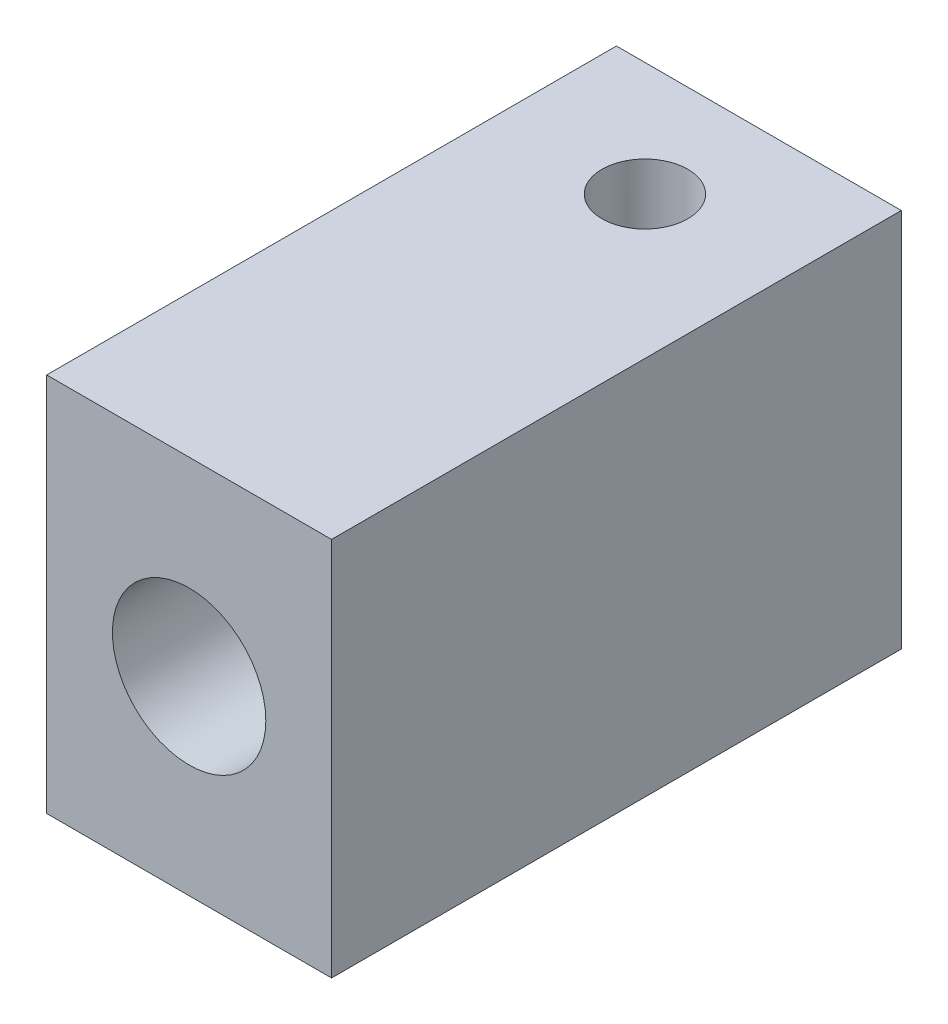
ISO-10303-21;
HEADER;
FILE_DESCRIPTION(('STEP AP214'),'2;1');
FILE_NAME('part.step','',(''),(''),'','','');
FILE_SCHEMA(('AUTOMOTIVE_DESIGN { 1 0 10303 214 1 1 1 1 }'));
ENDSEC;
DATA;
#1=APPLICATION_CONTEXT('core data for automotive mechanical design processes');
#2=APPLICATION_PROTOCOL_DEFINITION('international standard','automotive_design',2000,#1);
#3=PRODUCT_CONTEXT('',#1,'mechanical');
#4=PRODUCT('Part','Part','',(#3));
#5=PRODUCT_RELATED_PRODUCT_CATEGORY('part','',(#4));
#6=PRODUCT_DEFINITION_FORMATION('','',#4);
#7=PRODUCT_DEFINITION_CONTEXT('part definition',#1,'design');
#8=PRODUCT_DEFINITION('design','',#6,#7);
#9=PRODUCT_DEFINITION_SHAPE('','',#8);
#10=(LENGTH_UNIT() NAMED_UNIT(*) SI_UNIT(.MILLI.,.METRE.));
#11=(NAMED_UNIT(*) PLANE_ANGLE_UNIT() SI_UNIT($,.RADIAN.));
#12=(NAMED_UNIT(*) SI_UNIT($,.STERADIAN.) SOLID_ANGLE_UNIT());
#13=UNCERTAINTY_MEASURE_WITH_UNIT(LENGTH_MEASURE(1.E-05),#10,'distance_accuracy_value','');
#14=(GEOMETRIC_REPRESENTATION_CONTEXT(3) GLOBAL_UNCERTAINTY_ASSIGNED_CONTEXT((#13)) GLOBAL_UNIT_ASSIGNED_CONTEXT((#10,
#11,#12)) REPRESENTATION_CONTEXT('',''));
#15=CARTESIAN_POINT('',(0.,0.,0.));
#16=DIRECTION('',(0.,0.,1.));
#17=DIRECTION('',(1.,0.,0.));
#18=AXIS2_PLACEMENT_3D('',#15,#16,#17);
#19=CARTESIAN_POINT('',(-4.66304347826087,2.23913043478261,15.));
#20=DIRECTION('',(0.,0.,-1.));
#21=DIRECTION('',(-1.,0.,0.));
#22=AXIS2_PLACEMENT_3D('',#19,#20,#21);
#23=CYLINDRICAL_SURFACE('',#22,1.1);
#24=CARTESIAN_POINT('',(-5.76304347826087,2.23913043478261,3.25995786196997));
#25=CARTESIAN_POINT('',(-5.76304202984464,2.25692156335631,3.25996743238746));
#26=CARTESIAN_POINT('',(-5.76260412839036,2.27474189413633,3.26183738780478));
#27=CARTESIAN_POINT('',(-5.76091788793131,2.30972254960981,3.26881457219472));
#28=CARTESIAN_POINT('',(-5.75966543122651,2.32687904909059,3.27393824608749));
#29=CARTESIAN_POINT('',(-5.75542488410556,2.37136076469578,3.29050074038941));
#30=CARTESIAN_POINT('',(-5.75183652945316,2.39787262369145,3.30387376602195));
#31=CARTESIAN_POINT('',(-5.74314937282368,2.44900373270586,3.33345642892709));
#32=CARTESIAN_POINT('',(-5.73804332131031,2.47361316789121,3.34967952437635));
#33=CARTESIAN_POINT('',(-5.7232425484458,2.53484972201438,3.39283805494884));
#34=CARTESIAN_POINT('',(-5.71257379296082,2.57056794945104,3.42072248982322));
#35=CARTESIAN_POINT('',(-5.68801745666639,2.64010804758875,3.47746698613262));
#36=CARTESIAN_POINT('',(-5.67412487293764,2.67392686831241,3.50632850378182));
#37=CARTESIAN_POINT('',(-5.64307189579393,2.7400058004621,3.56408920713508));
#38=CARTESIAN_POINT('',(-5.62591173427369,2.77226602229581,3.59298839002164));
#39=CARTESIAN_POINT('',(-5.58823994527732,2.8352475248608,3.65020265086913));
#40=CARTESIAN_POINT('',(-5.5677310593376,2.86597003782636,3.6785181854724));
#41=CARTESIAN_POINT('',(-5.51004427419463,2.9434848002313,3.75058806672391));
#42=CARTESIAN_POINT('',(-5.47017867317616,2.98904261620317,3.79357590917881));
#43=CARTESIAN_POINT('',(-5.38110292180772,3.07470914645192,3.87498446052813));
#44=CARTESIAN_POINT('',(-5.33191358862542,3.11482966475285,3.91341503950037));
#45=CARTESIAN_POINT('',(-5.23784781455594,3.17824626851377,3.97440357278692));
#46=CARTESIAN_POINT('',(-5.19510868192778,3.20321688909233,3.99850307899509));
#47=CARTESIAN_POINT('',(-5.10460139320199,3.24787393881108,4.04168573624983));
#48=CARTESIAN_POINT('',(-5.05683894096868,3.2675662730262,4.06077449256676));
#49=CARTESIAN_POINT('',(-4.96462111635331,3.29792207694609,4.09023236882376));
#50=CARTESIAN_POINT('',(-4.92075049081482,3.30949853112091,4.10148159832432));
#51=CARTESIAN_POINT('',(-4.83091512625936,3.32720687300066,4.11869748658754));
#52=CARTESIAN_POINT('',(-4.78495164570597,3.3333419883681,4.1246672769719));
#53=CARTESIAN_POINT('',(-4.69209020076544,3.33973382440618,4.13088697749982));
#54=CARTESIAN_POINT('',(-4.64518992180941,3.33997352470415,4.13112032623439));
#55=CARTESIAN_POINT('',(-4.55207074206756,3.3345122392381,4.12580593456318));
#56=CARTESIAN_POINT('',(-4.50585193860986,3.32881041308419,4.12025737634465));
#57=CARTESIAN_POINT('',(-4.41738005657088,3.31225222160596,4.10415801298817));
#58=CARTESIAN_POINT('',(-4.37504191494482,3.30162563246535,4.09383022277266));
#59=CARTESIAN_POINT('',(-4.2930782852121,3.27593982430762,4.0688977097035));
#60=CARTESIAN_POINT('',(-4.25345381045951,3.26087896042193,4.05429139976797));
#61=CARTESIAN_POINT('',(-4.16237361023026,3.22030417590561,4.01500968644353));
#62=CARTESIAN_POINT('',(-4.11244047712288,3.19301217887642,3.98863696740781));
#63=CARTESIAN_POINT('',(-4.01936097201772,3.1328639603237,3.93073650868733));
#64=CARTESIAN_POINT('',(-3.97622981015617,3.09999560039696,3.89919752857183));
#65=CARTESIAN_POINT('',(-3.88206514062166,3.01715783910102,3.8201821758641));
#66=CARTESIAN_POINT('',(-3.83398917797516,2.96535376007229,3.77111950795292));
#67=CARTESIAN_POINT('',(-3.74976566796874,2.85614158519799,3.66922460217595));
#68=CARTESIAN_POINT('',(-3.71362924916669,2.7987283253778,3.61638890301836));
#69=CARTESIAN_POINT('',(-3.66345339107535,2.70030169691803,3.52910919279121));
#70=CARTESIAN_POINT('',(-3.64613124390974,2.66075324028943,3.49483510118186));
#71=CARTESIAN_POINT('',(-3.61599940476486,2.57914027990991,3.42733452427061));
#72=CARTESIAN_POINT('',(-3.60318147093975,2.53708053812963,3.39410622791395));
#73=CARTESIAN_POINT('',(-3.58794498894286,2.47275929268058,3.34923651656145));
#74=CARTESIAN_POINT('',(-3.58367280742767,2.45224983508988,3.33572760960861));
#75=CARTESIAN_POINT('',(-3.57616625939737,2.40989914127057,3.31055595366563));
#76=CARTESIAN_POINT('',(-3.57293132581379,2.38805864052916,3.29889219769569));
#77=CARTESIAN_POINT('',(-3.56853998201005,2.35003065047467,3.28229327236621));
#78=CARTESIAN_POINT('',(-3.56704974013343,2.33431232864633,3.27640324603437));
#79=CARTESIAN_POINT('',(-3.56473237167539,2.30214543947803,3.2670474016854));
#80=CARTESIAN_POINT('',(-3.56390277674675,2.28569983500821,3.26357256614566));
#81=CARTESIAN_POINT('',(-3.56299244917421,2.25219103246751,3.25975154051829));
#82=CARTESIAN_POINT('',(-3.56292119328755,2.2351226877681,3.25944494442878));
#83=CARTESIAN_POINT('',(-3.5635643522341,2.20126172756535,3.26215450956048));
#84=CARTESIAN_POINT('',(-3.56428008336151,2.18446962183639,3.26517623766561));
#85=CARTESIAN_POINT('',(-3.56675290814509,2.14624995930651,3.27524173017821));
#86=CARTESIAN_POINT('',(-3.56877539258835,2.12511779398725,3.28328257505928));
#87=CARTESIAN_POINT('',(-3.573813996874,2.08418508186905,3.30208119570021));
#88=CARTESIAN_POINT('',(-3.57683549868156,2.06439246305172,3.31285361222076));
#89=CARTESIAN_POINT('',(-3.58590586155399,2.01375655290057,3.34312050478321));
#90=CARTESIAN_POINT('',(-3.59266364475598,1.98379059641202,3.36384004055668));
#91=CARTESIAN_POINT('',(-3.60825631473124,1.92555444666572,3.40685940310628));
#92=CARTESIAN_POINT('',(-3.61709584096879,1.89728822075011,3.42916268078441));
#93=CARTESIAN_POINT('',(-3.63684339996749,1.84191659787366,3.47445018277957));
#94=CARTESIAN_POINT('',(-3.64775674925715,1.81481440896243,3.4974360262756));
#95=CARTESIAN_POINT('',(-3.6716426744066,1.76166757787371,3.54348544381327));
#96=CARTESIAN_POINT('',(-3.68461327204409,1.73562194963128,3.56654892255869));
#97=CARTESIAN_POINT('',(-3.7294969120017,1.65379569148066,3.63997237502955));
#98=CARTESIAN_POINT('',(-3.76548093950229,1.59979111215946,3.68991752316887));
#99=CARTESIAN_POINT('',(-3.84830253133314,1.4971599157433,3.78599884416798));
#100=CARTESIAN_POINT('',(-3.89510978744304,1.44851883085125,3.83214517438103));
#101=CARTESIAN_POINT('',(-3.98602538044757,1.37068662808733,3.90646457461495));
#102=CARTESIAN_POINT('',(-4.0274472726292,1.33979083150459,3.93612546350313));
#103=CARTESIAN_POINT('',(-4.11646861555114,1.28308016286914,3.99073310534093));
#104=CARTESIAN_POINT('',(-4.16406178891903,1.25726019397885,4.01568458617671));
#105=CARTESIAN_POINT('',(-4.25621351160494,1.21610747926852,4.05552473568121));
#106=CARTESIAN_POINT('',(-4.29987187790399,1.19973312226909,4.07140757844398));
#107=CARTESIAN_POINT('',(-4.3903817577433,1.17241379143515,4.09793065140252));
#108=CARTESIAN_POINT('',(-4.43723101557245,1.16146502652541,4.10857454222553));
#109=CARTESIAN_POINT('',(-4.53321783019467,1.14573122273902,4.12387566887657));
#110=CARTESIAN_POINT('',(-4.58236703749928,1.14098213746161,4.12849798365546));
#111=CARTESIAN_POINT('',(-4.68103577081436,1.13817193644223,4.1312327655113));
#112=CARTESIAN_POINT('',(-4.730555201667,1.14010915736384,4.12934685162476));
#113=CARTESIAN_POINT('',(-4.82358659426562,1.14999916374567,4.11972493521201));
#114=CARTESIAN_POINT('',(-4.86722379478441,1.15736571029336,4.11255906308958));
#115=CARTESIAN_POINT('',(-4.95231459557117,1.17694887193364,4.09352752703682));
#116=CARTESIAN_POINT('',(-4.9937677222926,1.18916653397372,4.08166084859938));
#117=CARTESIAN_POINT('',(-5.07628909452977,1.21870396007352,4.05301210326653));
#118=CARTESIAN_POINT('',(-5.11716536325337,1.23629868627169,4.03596552503223));
#119=CARTESIAN_POINT('',(-5.19512824640087,1.2753924686259,3.99817036042982));
#120=CARTESIAN_POINT('',(-5.23221349933046,1.29689291982785,3.97742045135345));
#121=CARTESIAN_POINT('',(-5.32225064503326,1.35608677888888,3.92046007960291));
#122=CARTESIAN_POINT('',(-5.37235824883861,1.39607492300427,3.88212922735891));
#123=CARTESIAN_POINT('',(-5.46318503944131,1.48170423170636,3.80068212176098));
#124=CARTESIAN_POINT('',(-5.50386785689384,1.52736628380901,3.75754825127072));
#125=CARTESIAN_POINT('',(-5.56370443952876,1.60640210968032,3.68395574642606));
#126=CARTESIAN_POINT('',(-5.58544280372698,1.63857850005985,3.65425986599595));
#127=CARTESIAN_POINT('',(-5.62522873004572,1.70463127967671,3.59420051700583));
#128=CARTESIAN_POINT('',(-5.64327241667805,1.73850940802967,3.56383638407775));
#129=CARTESIAN_POINT('',(-5.67570881917522,1.80788644904845,3.50325534159816));
#130=CARTESIAN_POINT('',(-5.69011173495948,1.84338049734566,3.47303825867273));
#131=CARTESIAN_POINT('',(-5.71537582694509,1.91648418388774,3.41375684165734));
#132=CARTESIAN_POINT('',(-5.72624393391357,1.9540895105641,3.38469035112288));
#133=CARTESIAN_POINT('',(-5.73980724416575,2.01332326434638,3.34404647818908));
#134=CARTESIAN_POINT('',(-5.74387845279662,2.03359191631187,3.33096279143475));
#135=CARTESIAN_POINT('',(-5.75100316349188,2.07544040353468,3.30672215660767));
#136=CARTESIAN_POINT('',(-5.75405832648633,2.09701803003937,3.29556207854428));
#137=CARTESIAN_POINT('',(-5.75822515756423,2.13508942787357,3.27964630361837));
#138=CARTESIAN_POINT('',(-5.75964507989362,2.15115360537918,3.27397419995838));
#139=CARTESIAN_POINT('',(-5.76178330293547,2.18401271225461,3.2652737680339));
#140=CARTESIAN_POINT('',(-5.76250461285836,2.2008041790456,3.26223410680792));
#141=CARTESIAN_POINT('',(-5.76297420187904,2.22484045405145,3.26025042414968));
#142=CARTESIAN_POINT('',(-5.76304406014263,2.23198308791189,3.25995401718332));
#143=CARTESIAN_POINT('',(-5.76304347826087,2.23913043478261,3.25995786196997));
#144=B_SPLINE_CURVE_WITH_KNOTS('',3,(#24,#25,#26,#27,#28,#29,#30,#31,#32,#33,#34,#35,#36,#37,
#38,#39,#40,#41,#42,#43,#44,#45,#46,#47,#48,#49,#50,#51,#52,#53,#54,#55,#56,#57,#58,#59,#60,#61,
#62,#63,#64,#65,#66,#67,#68,#69,#70,#71,#72,#73,#74,#75,#76,#77,#78,#79,#80,#81,#82,#83,#84,#85,
#86,#87,#88,#89,#90,#91,#92,#93,#94,#95,#96,#97,#98,#99,#100,#101,#102,#103,#104,#105,#106,#107,
#108,#109,#110,#111,#112,#113,#114,#115,#116,#117,#118,#119,#120,#121,#122,#123,#124,#125,#126,
#127,#128,#129,#130,#131,#132,#133,#134,#135,#136,#137,#138,#139,#140,#141,#142,#143),
.UNSPECIFIED.,.T.,.F.,(4,2,2,2,2,2,2,2,2,2,2,2,2,2,2,2,2,2,2,2,2,2,2,2,2,2,2,2,2,2,2,2,2,2,2,2,
2,2,2,2,2,2,2,2,2,2,2,2,2,2,2,2,2,2,2,2,2,2,2,4),(0.,0.0533426910420637,0.106957155695794,
0.196176524477837,0.285829107453229,0.425229406600042,0.564847499088044,0.704455686796717,
0.843950147808111,1.06589174474377,1.28734352664652,1.45191584352115,1.61630326953405,
1.7559410213299,1.89549588809166,2.03545360992971,2.17543113055567,2.3094494464229,
2.44351753837802,2.630635535726,2.8181661964035,3.0749013799203,3.331875189383,3.49708416617617,
3.66198924853849,3.7367099429019,3.8113897171714,3.86180299462687,3.91202701958199,
3.9628779543289,4.01381407059116,4.08153086041255,4.14961856949937,4.26052083977127,
4.37167265058426,4.48311335535701,4.59444754276799,4.83922069465635,5.08331653753397,
5.26147511476181,5.4394538717954,5.58663227720997,5.73370769774582,5.88163231360184,
6.02952013325713,6.1634217043346,6.29735218921119,6.43979644086572,6.58229167112106,
6.80513446872085,7.02882338020418,7.17531734893754,7.32196420237837,7.46819554181519,
7.61413840955297,7.68746973666915,7.76068059295988,7.8118098699113,7.86271791947203,
7.88414762890928),.UNSPECIFIED.);
#145=CARTESIAN_POINT('',(-5.76304347826087,2.23913043478261,3.25995786196997));
#146=VERTEX_POINT('',#145);
#147=EDGE_CURVE('E119',#146,#146,#144,.T.);
#148=ORIENTED_EDGE('',*,*,#147,.T.);
#149=EDGE_LOOP('',(#148));
#150=FACE_BOUND('',#149,.T.);
#151=CARTESIAN_POINT('',(-4.66304347826087,2.23913043478261,7.5));
#152=DIRECTION('',(0.,0.,1.));
#153=DIRECTION('',(1.,0.,0.));
#154=AXIS2_PLACEMENT_3D('',#151,#152,#153);
#155=CIRCLE('',#154,1.1);
#156=CARTESIAN_POINT('',(-3.56304347826087,2.23913043478261,7.5));
#157=VERTEX_POINT('',#156);
#158=EDGE_CURVE('E37',#157,#157,#155,.F.);
#159=ORIENTED_EDGE('',*,*,#158,.F.);
#160=EDGE_LOOP('',(#159));
#161=FACE_BOUND('',#160,.T.);
#162=ADVANCED_FACE('F33',(#150,#161),#23,.F.);
#163=CARTESIAN_POINT('',(-5.76304347826087,2.23913043478261,2.74004213803004));
#164=CARTESIAN_POINT('',(-5.76304202984464,2.22133930620891,2.74003256761254));
#165=CARTESIAN_POINT('',(-5.76260412839036,2.20351897542889,2.73816261219522));
#166=CARTESIAN_POINT('',(-5.76091788793131,2.16853831995541,2.73118542780528));
#167=CARTESIAN_POINT('',(-5.75966543122651,2.15138182047463,2.72606175391251));
#168=CARTESIAN_POINT('',(-5.75542488410556,2.10690010486944,2.70949925961059));
#169=CARTESIAN_POINT('',(-5.75183652945316,2.08038824587377,2.69612623397805));
#170=CARTESIAN_POINT('',(-5.74314937282368,2.02925713685935,2.66654357107291));
#171=CARTESIAN_POINT('',(-5.73804332131031,2.00464770167401,2.65032047562365));
#172=CARTESIAN_POINT('',(-5.7232425484458,1.94341114755083,2.60716194505116));
#173=CARTESIAN_POINT('',(-5.71257379296082,1.90769292011418,2.57927751017678));
#174=CARTESIAN_POINT('',(-5.68801745666639,1.83815282197647,2.52253301386738));
#175=CARTESIAN_POINT('',(-5.67412487293764,1.80433400125281,2.49367149621818));
#176=CARTESIAN_POINT('',(-5.64307189579393,1.73825506910312,2.43591079286492));
#177=CARTESIAN_POINT('',(-5.62591173427368,1.70599484726941,2.40701160997836));
#178=CARTESIAN_POINT('',(-5.58823994527732,1.64301334470442,2.34979734913087));
#179=CARTESIAN_POINT('',(-5.56773105933759,1.61229083173885,2.3214818145276));
#180=CARTESIAN_POINT('',(-5.51004427419463,1.53477606933391,2.24941193327609));
#181=CARTESIAN_POINT('',(-5.47017867317616,1.48921825336205,2.20642409082119));
#182=CARTESIAN_POINT('',(-5.38110292180772,1.4035517231133,2.12501553947187));
#183=CARTESIAN_POINT('',(-5.33191358862542,1.36343120481236,2.08658496049963));
#184=CARTESIAN_POINT('',(-5.23784781455594,1.30001460105145,2.02559642721308));
#185=CARTESIAN_POINT('',(-5.19510868192778,1.27504398047289,2.00149692100491));
#186=CARTESIAN_POINT('',(-5.10460139320199,1.23038693075414,1.95831426375017));
#187=CARTESIAN_POINT('',(-5.05683894096868,1.21069459653902,1.93922550743324));
#188=CARTESIAN_POINT('',(-4.96462111635331,1.18033879261913,1.90976763117624));
#189=CARTESIAN_POINT('',(-4.92075049081482,1.16876233844431,1.89851840167568));
#190=CARTESIAN_POINT('',(-4.83091512625936,1.15105399656456,1.88130251341246));
#191=CARTESIAN_POINT('',(-4.78495164570597,1.14491888119711,1.8753327230281));
#192=CARTESIAN_POINT('',(-4.69209020076544,1.13852704515904,1.86911302250018));
#193=CARTESIAN_POINT('',(-4.64518992180941,1.13828734486107,1.86887967376562));
#194=CARTESIAN_POINT('',(-4.55207074206756,1.14374863032712,1.87419406543682));
#195=CARTESIAN_POINT('',(-4.50585193860986,1.14945045648103,1.87974262365535));
#196=CARTESIAN_POINT('',(-4.41738005657088,1.16600864795926,1.89584198701183));
#197=CARTESIAN_POINT('',(-4.37504191494482,1.17663523709986,1.90616977722734));
#198=CARTESIAN_POINT('',(-4.2930782852121,1.20232104525759,1.9311022902965));
#199=CARTESIAN_POINT('',(-4.25345381045951,1.21738190914329,1.94570860023203));
#200=CARTESIAN_POINT('',(-4.16237361023026,1.25795669365961,1.98499031355647));
#201=CARTESIAN_POINT('',(-4.11244047712288,1.2852486906888,2.01136303259219));
#202=CARTESIAN_POINT('',(-4.01936097201772,1.34539690924152,2.06926349131267));
#203=CARTESIAN_POINT('',(-3.97622981015617,1.37826526916825,2.10080247142817));
#204=CARTESIAN_POINT('',(-3.88206514062166,1.4611030304642,2.1798178241359));
#205=CARTESIAN_POINT('',(-3.83398917797516,1.51290710949293,2.22888049204708));
#206=CARTESIAN_POINT('',(-3.74976566796874,1.62211928436723,2.33077539782405));
#207=CARTESIAN_POINT('',(-3.71362924916669,1.67953254418742,2.38361109698164));
#208=CARTESIAN_POINT('',(-3.66345339107535,1.77795917264719,2.47089080720879));
#209=CARTESIAN_POINT('',(-3.64613124390974,1.81750762927579,2.50516489881814));
#210=CARTESIAN_POINT('',(-3.61599940476486,1.89912058965531,2.57266547572939));
#211=CARTESIAN_POINT('',(-3.60318147093975,1.94118033143559,2.60589377208605));
#212=CARTESIAN_POINT('',(-3.58794498894286,2.00550157688464,2.65076348343855));
#213=CARTESIAN_POINT('',(-3.58367280742767,2.02601103447534,2.66427239039139));
#214=CARTESIAN_POINT('',(-3.57616625939737,2.06836172829465,2.68944404633437));
#215=CARTESIAN_POINT('',(-3.57293132581379,2.09020222903606,2.70110780230431));
#216=CARTESIAN_POINT('',(-3.56853998201005,2.12823021909054,2.71770672763379));
#217=CARTESIAN_POINT('',(-3.56704974013343,2.14394854091889,2.72359675396563));
#218=CARTESIAN_POINT('',(-3.56473237167539,2.17611543008719,2.7329525983146));
#219=CARTESIAN_POINT('',(-3.56390277674675,2.19256103455701,2.73642743385434));
#220=CARTESIAN_POINT('',(-3.56299244917421,2.22606983709771,2.74024845948171));
#221=CARTESIAN_POINT('',(-3.56292119328755,2.24313818179712,2.74055505557122));
#222=CARTESIAN_POINT('',(-3.5635643522341,2.27699914199986,2.73784549043952));
#223=CARTESIAN_POINT('',(-3.56428008336151,2.29379124772883,2.73482376233439));
#224=CARTESIAN_POINT('',(-3.56675290814509,2.33201091025871,2.72475826982179));
#225=CARTESIAN_POINT('',(-3.56877539258835,2.35314307557797,2.71671742494072));
#226=CARTESIAN_POINT('',(-3.573813996874,2.39407578769617,2.69791880429979));
#227=CARTESIAN_POINT('',(-3.57683549868156,2.41386840651349,2.68714638777924));
#228=CARTESIAN_POINT('',(-3.58590586155399,2.46450431666465,2.65687949521679));
#229=CARTESIAN_POINT('',(-3.59266364475598,2.4944702731532,2.63615995944332));
#230=CARTESIAN_POINT('',(-3.60825631473124,2.5527064228995,2.59314059689372));
#231=CARTESIAN_POINT('',(-3.61709584096879,2.58097264881511,2.57083731921559));
#232=CARTESIAN_POINT('',(-3.63684339996749,2.63634427169156,2.52554981722043));
#233=CARTESIAN_POINT('',(-3.64775674925715,2.66344646060279,2.5025639737244));
#234=CARTESIAN_POINT('',(-3.6716426744066,2.71659329169151,2.45651455618673));
#235=CARTESIAN_POINT('',(-3.68461327204409,2.74263891993394,2.43345107744131));
#236=CARTESIAN_POINT('',(-3.7294969120017,2.82446517808456,2.36002762497045));
#237=CARTESIAN_POINT('',(-3.76548093950229,2.87846975740576,2.31008247683113));
#238=CARTESIAN_POINT('',(-3.84830253133314,2.98110095382192,2.21400115583202));
#239=CARTESIAN_POINT('',(-3.89510978744304,3.02974203871396,2.16785482561897));
#240=CARTESIAN_POINT('',(-3.98602538044757,3.10757424147789,2.09353542538505));
#241=CARTESIAN_POINT('',(-4.0274472726292,3.13847003806062,2.06387453649687));
#242=CARTESIAN_POINT('',(-4.11646861555114,3.19518070669607,2.00926689465907));
#243=CARTESIAN_POINT('',(-4.16406178891903,3.22100067558637,1.98431541382329));
#244=CARTESIAN_POINT('',(-4.25621351160494,3.2621533902967,1.94447526431879));
#245=CARTESIAN_POINT('',(-4.29987187790398,3.27852774729613,1.92859242155603));
#246=CARTESIAN_POINT('',(-4.3903817577433,3.30584707813007,1.90206934859748));
#247=CARTESIAN_POINT('',(-4.43723101557245,3.31679584303981,1.89142545777448));
#248=CARTESIAN_POINT('',(-4.53321783019467,3.3325296468262,1.87612433112344));
#249=CARTESIAN_POINT('',(-4.58236703749927,3.33727873210361,1.87150201634454));
#250=CARTESIAN_POINT('',(-4.68103577081436,3.34008893312299,1.8687672344887));
#251=CARTESIAN_POINT('',(-4.730555201667,3.33815171220137,1.87065314837524));
#252=CARTESIAN_POINT('',(-4.82358659426562,3.32826170581955,1.88027506478799));
#253=CARTESIAN_POINT('',(-4.86722379478441,3.32089515927186,1.88744093691042));
#254=CARTESIAN_POINT('',(-4.95231459557117,3.30131199763158,1.90647247296318));
#255=CARTESIAN_POINT('',(-4.9937677222926,3.2890943355915,1.91833915140062));
#256=CARTESIAN_POINT('',(-5.07628909452977,3.2595569094917,1.94698789673347));
#257=CARTESIAN_POINT('',(-5.11716536325336,3.24196218329353,1.96403447496777));
#258=CARTESIAN_POINT('',(-5.19512824640087,3.20286840093932,2.00182963957018));
#259=CARTESIAN_POINT('',(-5.23221349933046,3.18136794973737,2.02257954864655));
#260=CARTESIAN_POINT('',(-5.32225064503326,3.12217409067634,2.07953992039709));
#261=CARTESIAN_POINT('',(-5.3723582488386,3.08218594656095,2.11787077264109));
#262=CARTESIAN_POINT('',(-5.4631850394413,2.99655663785886,2.19931787823902));
#263=CARTESIAN_POINT('',(-5.50386785689384,2.95089458575621,2.24245174872928));
#264=CARTESIAN_POINT('',(-5.56370443952876,2.8718587598849,2.31604425357394));
#265=CARTESIAN_POINT('',(-5.58544280372698,2.83968236950538,2.34574013400405));
#266=CARTESIAN_POINT('',(-5.62522873004571,2.77362958988851,2.40579948299417));
#267=CARTESIAN_POINT('',(-5.64327241667805,2.73975146153555,2.43616361592225));
#268=CARTESIAN_POINT('',(-5.67570881917522,2.67037442051677,2.49674465840184));
#269=CARTESIAN_POINT('',(-5.69011173495948,2.63488037221956,2.52696174132727));
#270=CARTESIAN_POINT('',(-5.71537582694509,2.56177668567748,2.58624315834266));
#271=CARTESIAN_POINT('',(-5.72624393391357,2.52417135900112,2.61530964887711));
#272=CARTESIAN_POINT('',(-5.73980724416575,2.46493760521884,2.65595352181091));
#273=CARTESIAN_POINT('',(-5.74387845279662,2.44466895325335,2.66903720856525));
#274=CARTESIAN_POINT('',(-5.75100316349188,2.40282046603054,2.69327784339233));
#275=CARTESIAN_POINT('',(-5.75405832648633,2.38124283952585,2.70443792145572));
#276=CARTESIAN_POINT('',(-5.75822515756423,2.34317144169165,2.72035369638163));
#277=CARTESIAN_POINT('',(-5.75964507989362,2.32710726418604,2.72602580004162));
#278=CARTESIAN_POINT('',(-5.76178330293547,2.29424815731061,2.7347262319661));
#279=CARTESIAN_POINT('',(-5.76250461285836,2.27745669051962,2.73776589319208));
#280=CARTESIAN_POINT('',(-5.76297420187904,2.25342041551377,2.73974957585032));
#281=CARTESIAN_POINT('',(-5.76304406014263,2.24627778165333,2.74004598281668));
#282=CARTESIAN_POINT('',(-5.76304347826087,2.23913043478261,2.74004213803004));
#283=B_SPLINE_CURVE_WITH_KNOTS('',3,(#163,#164,#165,#166,#167,#168,#169,#170,#171,#172,#173,
#174,#175,#176,#177,#178,#179,#180,#181,#182,#183,#184,#185,#186,#187,#188,#189,#190,#191,#192,
#193,#194,#195,#196,#197,#198,#199,#200,#201,#202,#203,#204,#205,#206,#207,#208,#209,#210,#211,
#212,#213,#214,#215,#216,#217,#218,#219,#220,#221,#222,#223,#224,#225,#226,#227,#228,#229,#230,
#231,#232,#233,#234,#235,#236,#237,#238,#239,#240,#241,#242,#243,#244,#245,#246,#247,#248,#249,
#250,#251,#252,#253,#254,#255,#256,#257,#258,#259,#260,#261,#262,#263,#264,#265,#266,#267,#268,
#269,#270,#271,#272,#273,#274,#275,#276,#277,#278,#279,#280,#281,#282),.UNSPECIFIED.,.T.,.F.,(4,
2,2,2,2,2,2,2,2,2,2,2,2,2,2,2,2,2,2,2,2,2,2,2,2,2,2,2,2,2,2,2,2,2,2,2,2,2,2,2,2,2,2,2,2,2,2,2,2,
2,2,2,2,2,2,2,2,2,2,4),(0.,0.0533426910420634,0.106957155695794,0.196176524477838,
0.285829107453229,0.425229406600042,0.564847499088045,0.704455686796717,0.843950147808112,
1.06589174474377,1.28734352664652,1.45191584352115,1.61630326953405,1.7559410213299,
1.89549588809166,2.03545360992971,2.17543113055567,2.3094494464229,2.44351753837802,
2.630635535726,2.8181661964035,3.0749013799203,3.331875189383,3.49708416617617,3.66198924853849,
3.7367099429019,3.8113897171714,3.86180299462687,3.91202701958199,3.9628779543289,
4.01381407059116,4.08153086041255,4.14961856949937,4.26052083977127,4.37167265058426,
4.48311335535701,4.594447542768,4.83922069465636,5.08331653753398,5.26147511476181,
5.4394538717954,5.58663227720997,5.73370769774582,5.88163231360184,6.02952013325713,
6.1634217043346,6.29735218921119,6.43979644086571,6.58229167112106,6.80513446872084,
7.02882338020417,7.17531734893753,7.32196420237837,7.46819554181519,7.61413840955296,
7.68746973666915,7.76068059295987,7.8118098699113,7.86271791947203,7.88414762890928),.UNSPECIFIED.);
#284=CARTESIAN_POINT('',(-5.76304347826087,2.23913043478261,2.74004213803004));
#285=VERTEX_POINT('',#284);
#286=EDGE_CURVE('E128',#285,#285,#283,.T.);
#287=ORIENTED_EDGE('',*,*,#286,.T.);
#288=EDGE_LOOP('',(#287));
#289=FACE_BOUND('',#288,.T.);
#290=CARTESIAN_POINT('',(-4.66304347826087,2.23913043478261,0.));
#291=DIRECTION('',(0.,0.,-1.));
#292=DIRECTION('',(-1.,0.,0.));
#293=AXIS2_PLACEMENT_3D('',#290,#291,#292);
#294=CIRCLE('',#293,1.1);
#295=CARTESIAN_POINT('',(-5.76304347826087,2.23913043478261,0.));
#296=VERTEX_POINT('',#295);
#297=EDGE_CURVE('E102',#296,#296,#294,.T.);
#298=ORIENTED_EDGE('',*,*,#297,.T.);
#299=EDGE_LOOP('',(#298));
#300=FACE_BOUND('',#299,.T.);
#301=ADVANCED_FACE('F132',(#289,#300),#23,.F.);
#302=CARTESIAN_POINT('',(-8.41304347826087,7.23913043478261,15.));
#303=DIRECTION('',(1.,0.,0.));
#304=DIRECTION('',(0.,0.,-1.));
#305=AXIS2_PLACEMENT_3D('',#302,#303,#304);
#306=PLANE('',#305);
#307=DIRECTION('',(0.,-1.,0.));
#308=VECTOR('',#307,1.);
#309=CARTESIAN_POINT('',(-8.41304347826087,7.23913043478261,0.));
#310=LINE('',#309,#308);
#311=CARTESIAN_POINT('',(-8.41304347826087,7.23913043478261,0.));
#312=VERTEX_POINT('',#311);
#313=CARTESIAN_POINT('',(-8.41304347826087,-2.76086956521739,0.));
#314=VERTEX_POINT('',#313);
#315=EDGE_CURVE('E99',#312,#314,#310,.T.);
#316=ORIENTED_EDGE('',*,*,#315,.T.);
#317=DIRECTION('',(0.,0.,-1.));
#318=VECTOR('',#317,1.);
#319=CARTESIAN_POINT('',(-8.41304347826087,-2.76086956521739,15.));
#320=LINE('',#319,#318);
#321=CARTESIAN_POINT('',(-8.41304347826087,-2.76086956521739,15.));
#322=VERTEX_POINT('',#321);
#323=EDGE_CURVE('E11',#322,#314,#320,.T.);
#324=ORIENTED_EDGE('',*,*,#323,.F.);
#325=DIRECTION('',(0.,-1.,0.));
#326=VECTOR('',#325,1.);
#327=CARTESIAN_POINT('',(-8.41304347826087,7.23913043478261,15.));
#328=LINE('',#327,#326);
#329=CARTESIAN_POINT('',(-8.41304347826087,7.23913043478261,15.));
#330=VERTEX_POINT('',#329);
#331=EDGE_CURVE('E86',#330,#322,#328,.T.);
#332=ORIENTED_EDGE('',*,*,#331,.F.);
#333=DIRECTION('',(0.,0.,-1.));
#334=VECTOR('',#333,1.);
#335=CARTESIAN_POINT('',(-8.41304347826087,7.23913043478261,15.));
#336=LINE('',#335,#334);
#337=EDGE_CURVE('E95',#330,#312,#336,.T.);
#338=ORIENTED_EDGE('',*,*,#337,.T.);
#339=EDGE_LOOP('',(#316,#324,#332,#338));
#340=FACE_BOUND('',#339,.T.);
#341=ADVANCED_FACE('F35',(#340),#306,.F.);
#342=CARTESIAN_POINT('',(-8.41304347826087,-2.76086956521739,15.));
#343=DIRECTION('',(0.,1.,0.));
#344=DIRECTION('',(0.,0.,1.));
#345=AXIS2_PLACEMENT_3D('',#342,#343,#344);
#346=PLANE('',#345);
#347=CARTESIAN_POINT('',(-4.66304347826087,-2.76086956521739,3.));
#348=DIRECTION('',(0.,1.,0.));
#349=DIRECTION('',(-1.,0.,0.));
#350=AXIS2_PLACEMENT_3D('',#347,#348,#349);
#351=CIRCLE('',#350,1.1303);
#352=CARTESIAN_POINT('',(-5.79334347826087,-2.76086956521739,3.));
#353=VERTEX_POINT('',#352);
#354=EDGE_CURVE('E189',#353,#353,#351,.T.);
#355=ORIENTED_EDGE('',*,*,#354,.T.);
#356=EDGE_LOOP('',(#355));
#357=FACE_BOUND('',#356,.T.);
#358=DIRECTION('',(1.,0.,0.));
#359=VECTOR('',#358,1.);
#360=CARTESIAN_POINT('',(-8.41304347826087,-2.76086956521739,0.));
#361=LINE('',#360,#359);
#362=CARTESIAN_POINT('',(-0.913043478260869,-2.76086956521739,0.));
#363=VERTEX_POINT('',#362);
#364=EDGE_CURVE('E90',#314,#363,#361,.T.);
#365=ORIENTED_EDGE('',*,*,#364,.T.);
#366=DIRECTION('',(0.,0.,-1.));
#367=VECTOR('',#366,1.);
#368=CARTESIAN_POINT('',(-0.913043478260869,-2.76086956521739,15.));
#369=LINE('',#368,#367);
#370=CARTESIAN_POINT('',(-0.913043478260869,-2.76086956521739,15.));
#371=VERTEX_POINT('',#370);
#372=EDGE_CURVE('E43',#371,#363,#369,.T.);
#373=ORIENTED_EDGE('',*,*,#372,.F.);
#374=DIRECTION('',(1.,0.,0.));
#375=VECTOR('',#374,1.);
#376=CARTESIAN_POINT('',(-8.41304347826087,-2.76086956521739,15.));
#377=LINE('',#376,#375);
#378=EDGE_CURVE('E81',#322,#371,#377,.T.);
#379=ORIENTED_EDGE('',*,*,#378,.F.);
#380=ORIENTED_EDGE('',*,*,#323,.T.);
#381=EDGE_LOOP('',(#365,#373,#379,#380));
#382=FACE_BOUND('',#381,.T.);
#383=ADVANCED_FACE('F89',(#357,#382),#346,.F.);
#384=CARTESIAN_POINT('',(-0.91304347826087,7.23913043478261,15.));
#385=DIRECTION('',(-1.,0.,0.));
#386=DIRECTION('',(0.,-1.,0.));
#387=AXIS2_PLACEMENT_3D('',#384,#385,#386);
#388=PLANE('',#387);
#389=DIRECTION('',(0.,1.,0.));
#390=VECTOR('',#389,1.);
#391=CARTESIAN_POINT('',(-0.91304347826087,7.23913043478261,0.));
#392=LINE('',#391,#390);
#393=CARTESIAN_POINT('',(-0.91304347826087,7.23913043478261,0.));
#394=VERTEX_POINT('',#393);
#395=EDGE_CURVE('E68',#363,#394,#392,.T.);
#396=ORIENTED_EDGE('',*,*,#395,.T.);
#397=DIRECTION('',(0.,0.,-1.));
#398=VECTOR('',#397,1.);
#399=CARTESIAN_POINT('',(-0.91304347826087,7.23913043478261,15.));
#400=LINE('',#399,#398);
#401=CARTESIAN_POINT('',(-0.91304347826087,7.23913043478261,15.));
#402=VERTEX_POINT('',#401);
#403=EDGE_CURVE('E91',#402,#394,#400,.T.);
#404=ORIENTED_EDGE('',*,*,#403,.F.);
#405=DIRECTION('',(0.,1.,0.));
#406=VECTOR('',#405,1.);
#407=CARTESIAN_POINT('',(-0.91304347826087,7.23913043478261,15.));
#408=LINE('',#407,#406);
#409=EDGE_CURVE('E84',#371,#402,#408,.T.);
#410=ORIENTED_EDGE('',*,*,#409,.F.);
#411=ORIENTED_EDGE('',*,*,#372,.T.);
#412=EDGE_LOOP('',(#396,#404,#410,#411));
#413=FACE_BOUND('',#412,.T.);
#414=ADVANCED_FACE('F93',(#413),#388,.F.);
#415=CARTESIAN_POINT('',(-8.41304347826087,7.23913043478261,15.));
#416=DIRECTION('',(0.,-1.,0.));
#417=DIRECTION('',(0.,0.,-1.));
#418=AXIS2_PLACEMENT_3D('',#415,#416,#417);
#419=PLANE('',#418);
#420=CARTESIAN_POINT('',(-4.66304347826087,7.23913043478261,3.));
#421=DIRECTION('',(0.,1.,0.));
#422=DIRECTION('',(-1.,0.,0.));
#423=AXIS2_PLACEMENT_3D('',#420,#421,#422);
#424=CIRCLE('',#423,1.1303);
#425=CARTESIAN_POINT('',(-5.79334347826087,7.23913043478261,3.));
#426=VERTEX_POINT('',#425);
#427=EDGE_CURVE('E191',#426,#426,#424,.T.);
#428=ORIENTED_EDGE('',*,*,#427,.F.);
#429=EDGE_LOOP('',(#428));
#430=FACE_BOUND('',#429,.T.);
#431=DIRECTION('',(-1.,0.,0.));
#432=VECTOR('',#431,1.);
#433=CARTESIAN_POINT('',(-8.41304347826087,7.23913043478261,0.));
#434=LINE('',#433,#432);
#435=EDGE_CURVE('E74',#394,#312,#434,.T.);
#436=ORIENTED_EDGE('',*,*,#435,.T.);
#437=ORIENTED_EDGE('',*,*,#337,.F.);
#438=DIRECTION('',(-1.,0.,0.));
#439=VECTOR('',#438,1.);
#440=CARTESIAN_POINT('',(-8.41304347826087,7.23913043478261,15.));
#441=LINE('',#440,#439);
#442=EDGE_CURVE('E51',#402,#330,#441,.T.);
#443=ORIENTED_EDGE('',*,*,#442,.F.);
#444=ORIENTED_EDGE('',*,*,#403,.T.);
#445=EDGE_LOOP('',(#436,#437,#443,#444));
#446=FACE_BOUND('',#445,.T.);
#447=ADVANCED_FACE('F107',(#430,#446),#419,.F.);
#448=CARTESIAN_POINT('',(0.,0.,15.));
#449=DIRECTION('',(0.,0.,1.));
#450=DIRECTION('',(1.,0.,0.));
#451=AXIS2_PLACEMENT_3D('',#448,#449,#450);
#452=PLANE('',#451);
#453=CARTESIAN_POINT('',(-4.66304347826087,2.23913043478261,15.));
#454=DIRECTION('',(0.,0.,1.));
#455=DIRECTION('',(1.,0.,0.));
#456=AXIS2_PLACEMENT_3D('',#453,#454,#455);
#457=CIRCLE('',#456,2.0193);
#458=CARTESIAN_POINT('',(-2.64374347826087,2.23913043478261,15.));
#459=VERTEX_POINT('',#458);
#460=EDGE_CURVE('E115',#459,#459,#457,.T.);
#461=ORIENTED_EDGE('',*,*,#460,.F.);
#462=EDGE_LOOP('',(#461));
#463=FACE_BOUND('',#462,.T.);
#464=ORIENTED_EDGE('',*,*,#331,.T.);
#465=ORIENTED_EDGE('',*,*,#378,.T.);
#466=ORIENTED_EDGE('',*,*,#409,.T.);
#467=ORIENTED_EDGE('',*,*,#442,.T.);
#468=EDGE_LOOP('',(#464,#465,#466,#467));
#469=FACE_BOUND('',#468,.T.);
#470=ADVANCED_FACE('F82',(#463,#469),#452,.T.);
#471=CARTESIAN_POINT('',(0.,0.,0.));
#472=DIRECTION('',(0.,0.,1.));
#473=DIRECTION('',(1.,0.,0.));
#474=AXIS2_PLACEMENT_3D('',#471,#472,#473);
#475=PLANE('',#474);
#476=ORIENTED_EDGE('',*,*,#297,.F.);
#477=EDGE_LOOP('',(#476));
#478=FACE_BOUND('',#477,.T.);
#479=ORIENTED_EDGE('',*,*,#315,.F.);
#480=ORIENTED_EDGE('',*,*,#435,.F.);
#481=ORIENTED_EDGE('',*,*,#395,.F.);
#482=ORIENTED_EDGE('',*,*,#364,.F.);
#483=EDGE_LOOP('',(#479,#480,#481,#482));
#484=FACE_BOUND('',#483,.T.);
#485=ADVANCED_FACE('F110',(#478,#484),#475,.F.);
#486=CARTESIAN_POINT('',(-4.66304347826087,2.23913043478261,7.5));
#487=DIRECTION('',(0.,0.,1.));
#488=DIRECTION('',(1.,0.,0.));
#489=AXIS2_PLACEMENT_3D('',#486,#487,#488);
#490=PLANE('',#489);
#491=CARTESIAN_POINT('',(-4.66304347826087,2.23913043478261,7.5));
#492=DIRECTION('',(0.,0.,1.));
#493=DIRECTION('',(1.,0.,0.));
#494=AXIS2_PLACEMENT_3D('',#491,#492,#493);
#495=CIRCLE('',#494,2.0193);
#496=CARTESIAN_POINT('',(-2.64374347826087,2.23913043478261,7.5));
#497=VERTEX_POINT('',#496);
#498=EDGE_CURVE('E118',#497,#497,#495,.T.);
#499=ORIENTED_EDGE('',*,*,#498,.T.);
#500=EDGE_LOOP('',(#499));
#501=FACE_BOUND('',#500,.T.);
#502=ORIENTED_EDGE('',*,*,#158,.T.);
#503=EDGE_LOOP('',(#502));
#504=FACE_BOUND('',#503,.T.);
#505=ADVANCED_FACE('F142',(#501,#504),#490,.T.);
#506=CARTESIAN_POINT('',(-4.66304347826087,2.23913043478261,7.5));
#507=DIRECTION('',(0.,0.,1.));
#508=DIRECTION('',(1.,0.,0.));
#509=AXIS2_PLACEMENT_3D('',#506,#507,#508);
#510=CYLINDRICAL_SURFACE('',#509,2.0193);
#511=ORIENTED_EDGE('',*,*,#498,.F.);
#512=EDGE_LOOP('',(#511));
#513=FACE_BOUND('',#512,.T.);
#514=ORIENTED_EDGE('',*,*,#460,.T.);
#515=EDGE_LOOP('',(#514));
#516=FACE_BOUND('',#515,.T.);
#517=ADVANCED_FACE('F140',(#513,#516),#510,.F.);
#518=CARTESIAN_POINT('',(-4.66304347826087,-2.76086956521739,3.));
#519=DIRECTION('',(0.,1.,0.));
#520=DIRECTION('',(-1.,0.,0.));
#521=AXIS2_PLACEMENT_3D('',#518,#519,#520);
#522=CYLINDRICAL_SURFACE('',#521,1.1303);
#523=ORIENTED_EDGE('',*,*,#286,.F.);
#524=EDGE_LOOP('',(#523));
#525=FACE_BOUND('',#524,.T.);
#526=ORIENTED_EDGE('',*,*,#354,.F.);
#527=EDGE_LOOP('',(#526));
#528=FACE_BOUND('',#527,.T.);
#529=ORIENTED_EDGE('',*,*,#427,.T.);
#530=EDGE_LOOP('',(#529));
#531=FACE_BOUND('',#530,.T.);
#532=ORIENTED_EDGE('',*,*,#147,.F.);
#533=EDGE_LOOP('',(#532));
#534=FACE_BOUND('',#533,.T.);
#535=ADVANCED_FACE('F136',(#525,#528,#531,#534),#522,.F.);
#536=CLOSED_SHELL('',(#162,#301,#341,#383,#414,#447,#470,#485,#505,#517,#535));
#537=MANIFOLD_SOLID_BREP('B2',#536);
#538=ADVANCED_BREP_SHAPE_REPRESENTATION('',(#18,#537),#14);
#539=SHAPE_DEFINITION_REPRESENTATION(#9,#538);
ENDSEC;
END-ISO-10303-21;
